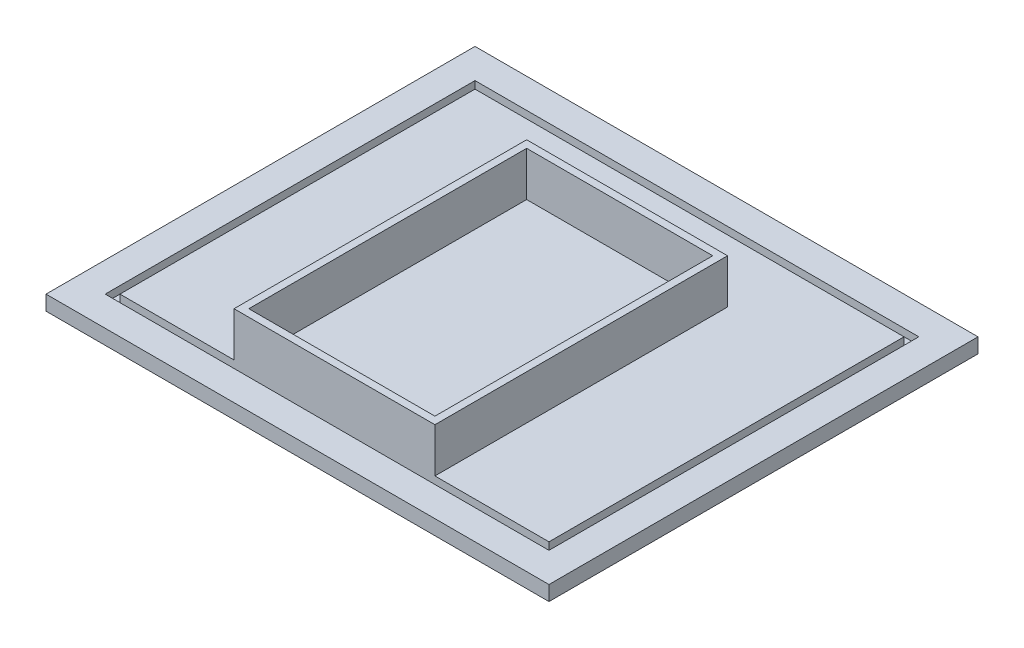
ISO-10303-21;
HEADER;
FILE_DESCRIPTION(('STEP AP214'),'2;1');
FILE_NAME('part.step','',(''),(''),'','','');
FILE_SCHEMA(('AUTOMOTIVE_DESIGN { 1 0 10303 214 1 1 1 1 }'));
ENDSEC;
DATA;
#1=APPLICATION_CONTEXT('core data for automotive mechanical design processes');
#2=APPLICATION_PROTOCOL_DEFINITION('international standard','automotive_design',2000,#1);
#3=PRODUCT_CONTEXT('',#1,'mechanical');
#4=PRODUCT('Part','Part','',(#3));
#5=PRODUCT_RELATED_PRODUCT_CATEGORY('part','',(#4));
#6=PRODUCT_DEFINITION_FORMATION('','',#4);
#7=PRODUCT_DEFINITION_CONTEXT('part definition',#1,'design');
#8=PRODUCT_DEFINITION('design','',#6,#7);
#9=PRODUCT_DEFINITION_SHAPE('','',#8);
#10=(LENGTH_UNIT() NAMED_UNIT(*) SI_UNIT(.MILLI.,.METRE.));
#11=(NAMED_UNIT(*) PLANE_ANGLE_UNIT() SI_UNIT($,.RADIAN.));
#12=(NAMED_UNIT(*) SI_UNIT($,.STERADIAN.) SOLID_ANGLE_UNIT());
#13=UNCERTAINTY_MEASURE_WITH_UNIT(LENGTH_MEASURE(1.E-05),#10,'distance_accuracy_value','');
#14=(GEOMETRIC_REPRESENTATION_CONTEXT(3) GLOBAL_UNCERTAINTY_ASSIGNED_CONTEXT((#13)) GLOBAL_UNIT_ASSIGNED_CONTEXT((#10,
#11,#12)) REPRESENTATION_CONTEXT('',''));
#15=CARTESIAN_POINT('',(0.,0.,0.));
#16=DIRECTION('',(0.,0.,1.));
#17=DIRECTION('',(1.,0.,0.));
#18=AXIS2_PLACEMENT_3D('',#15,#16,#17);
#19=CARTESIAN_POINT('',(0.,5.,0.));
#20=DIRECTION('',(0.,-1.,0.));
#21=DIRECTION('',(0.,0.,-1.));
#22=AXIS2_PLACEMENT_3D('',#19,#20,#21);
#23=PLANE('',#22);
#24=DIRECTION('',(0.,0.,1.));
#25=VECTOR('',#24,1.);
#26=CARTESIAN_POINT('',(-33.95,5.,60.));
#27=LINE('',#26,#25);
#28=CARTESIAN_POINT('',(-33.95,5.,-38.9));
#29=VERTEX_POINT('',#28);
#30=CARTESIAN_POINT('',(-33.95,5.,60.));
#31=VERTEX_POINT('',#30);
#32=EDGE_CURVE('E55',#29,#31,#27,.T.);
#33=ORIENTED_EDGE('',*,*,#32,.F.);
#34=DIRECTION('',(-1.,0.,0.));
#35=VECTOR('',#34,1.);
#36=CARTESIAN_POINT('',(33.95,5.,-38.9));
#37=LINE('',#36,#35);
#38=CARTESIAN_POINT('',(33.95,5.,-38.9));
#39=VERTEX_POINT('',#38);
#40=EDGE_CURVE('E234',#39,#29,#37,.T.);
#41=ORIENTED_EDGE('',*,*,#40,.F.);
#42=DIRECTION('',(0.,0.,-1.));
#43=VECTOR('',#42,1.);
#44=CARTESIAN_POINT('',(33.95,5.,60.));
#45=LINE('',#44,#43);
#46=CARTESIAN_POINT('',(33.95,5.,60.));
#47=VERTEX_POINT('',#46);
#48=EDGE_CURVE('E246',#47,#39,#45,.T.);
#49=ORIENTED_EDGE('',*,*,#48,.F.);
#50=DIRECTION('',(1.,0.,0.));
#51=VECTOR('',#50,1.);
#52=CARTESIAN_POINT('',(-72.5,5.,60.));
#53=LINE('',#52,#51);
#54=CARTESIAN_POINT('',(72.5,5.,60.));
#55=VERTEX_POINT('',#54);
#56=EDGE_CURVE('E267',#47,#55,#53,.T.);
#57=ORIENTED_EDGE('',*,*,#56,.T.);
#58=DIRECTION('',(0.,0.,-1.));
#59=VECTOR('',#58,1.);
#60=CARTESIAN_POINT('',(72.5,5.,-60.));
#61=LINE('',#60,#59);
#62=CARTESIAN_POINT('',(72.5,5.,-60.));
#63=VERTEX_POINT('',#62);
#64=EDGE_CURVE('E289',#55,#63,#61,.T.);
#65=ORIENTED_EDGE('',*,*,#64,.T.);
#66=DIRECTION('',(-1.,0.,0.));
#67=VECTOR('',#66,1.);
#68=CARTESIAN_POINT('',(-72.5,5.,-60.));
#69=LINE('',#68,#67);
#70=CARTESIAN_POINT('',(-72.5,5.,-60.));
#71=VERTEX_POINT('',#70);
#72=EDGE_CURVE('E293',#63,#71,#69,.T.);
#73=ORIENTED_EDGE('',*,*,#72,.T.);
#74=DIRECTION('',(0.,0.,1.));
#75=VECTOR('',#74,1.);
#76=CARTESIAN_POINT('',(-72.5,5.,-60.));
#77=LINE('',#76,#75);
#78=CARTESIAN_POINT('',(-72.5,5.,60.));
#79=VERTEX_POINT('',#78);
#80=EDGE_CURVE('E273',#71,#79,#77,.T.);
#81=ORIENTED_EDGE('',*,*,#80,.T.);
#82=EDGE_CURVE('E286',#79,#31,#53,.T.);
#83=ORIENTED_EDGE('',*,*,#82,.T.);
#84=EDGE_LOOP('',(#33,#41,#49,#57,#65,#73,#81,#83));
#85=FACE_BOUND('',#84,.T.);
#86=ADVANCED_FACE('F39',(#85),#23,.F.);
#87=CARTESIAN_POINT('',(85.,5.,72.5));
#88=DIRECTION('',(-1.,0.,0.));
#89=DIRECTION('',(0.,0.,1.));
#90=AXIS2_PLACEMENT_3D('',#87,#88,#89);
#91=PLANE('',#90);
#92=DIRECTION('',(0.,0.,-1.));
#93=VECTOR('',#92,1.);
#94=CARTESIAN_POINT('',(85.,0.,72.5));
#95=LINE('',#94,#93);
#96=CARTESIAN_POINT('',(85.,0.,72.5));
#97=VERTEX_POINT('',#96);
#98=CARTESIAN_POINT('',(85.,0.,-72.5));
#99=VERTEX_POINT('',#98);
#100=EDGE_CURVE('E348',#97,#99,#95,.T.);
#101=ORIENTED_EDGE('',*,*,#100,.T.);
#102=DIRECTION('',(0.,-1.,0.));
#103=VECTOR('',#102,1.);
#104=CARTESIAN_POINT('',(85.,5.,-72.5));
#105=LINE('',#104,#103);
#106=CARTESIAN_POINT('',(85.,5.,-72.5));
#107=VERTEX_POINT('',#106);
#108=EDGE_CURVE('E11',#107,#99,#105,.T.);
#109=ORIENTED_EDGE('',*,*,#108,.F.);
#110=DIRECTION('',(0.,0.,-1.));
#111=VECTOR('',#110,1.);
#112=CARTESIAN_POINT('',(85.,5.,72.5));
#113=LINE('',#112,#111);
#114=CARTESIAN_POINT('',(85.,5.,72.5));
#115=VERTEX_POINT('',#114);
#116=EDGE_CURVE('E358',#115,#107,#113,.T.);
#117=ORIENTED_EDGE('',*,*,#116,.F.);
#118=DIRECTION('',(0.,-1.,0.));
#119=VECTOR('',#118,1.);
#120=CARTESIAN_POINT('',(85.,5.,72.5));
#121=LINE('',#120,#119);
#122=EDGE_CURVE('E372',#115,#97,#121,.T.);
#123=ORIENTED_EDGE('',*,*,#122,.T.);
#124=EDGE_LOOP('',(#101,#109,#117,#123));
#125=FACE_BOUND('',#124,.T.);
#126=ADVANCED_FACE('F41',(#125),#91,.F.);
#127=CARTESIAN_POINT('',(-85.,5.,-72.5));
#128=DIRECTION('',(0.,0.,1.));
#129=DIRECTION('',(1.,0.,0.));
#130=AXIS2_PLACEMENT_3D('',#127,#128,#129);
#131=PLANE('',#130);
#132=DIRECTION('',(-1.,0.,0.));
#133=VECTOR('',#132,1.);
#134=CARTESIAN_POINT('',(-85.,0.,-72.5));
#135=LINE('',#134,#133);
#136=CARTESIAN_POINT('',(-85.,0.,-72.5));
#137=VERTEX_POINT('',#136);
#138=EDGE_CURVE('E376',#99,#137,#135,.T.);
#139=ORIENTED_EDGE('',*,*,#138,.T.);
#140=DIRECTION('',(0.,-1.,0.));
#141=VECTOR('',#140,1.);
#142=CARTESIAN_POINT('',(-85.,5.,-72.5));
#143=LINE('',#142,#141);
#144=CARTESIAN_POINT('',(-85.,5.,-72.5));
#145=VERTEX_POINT('',#144);
#146=EDGE_CURVE('E48',#145,#137,#143,.T.);
#147=ORIENTED_EDGE('',*,*,#146,.F.);
#148=DIRECTION('',(-1.,0.,0.));
#149=VECTOR('',#148,1.);
#150=CARTESIAN_POINT('',(-85.,5.,-72.5));
#151=LINE('',#150,#149);
#152=EDGE_CURVE('E362',#107,#145,#151,.T.);
#153=ORIENTED_EDGE('',*,*,#152,.F.);
#154=ORIENTED_EDGE('',*,*,#108,.T.);
#155=EDGE_LOOP('',(#139,#147,#153,#154));
#156=FACE_BOUND('',#155,.T.);
#157=ADVANCED_FACE('F412',(#156),#131,.F.);
#158=CARTESIAN_POINT('',(-85.,5.,72.5));
#159=DIRECTION('',(1.,0.,0.));
#160=DIRECTION('',(0.,0.,-1.));
#161=AXIS2_PLACEMENT_3D('',#158,#159,#160);
#162=PLANE('',#161);
#163=DIRECTION('',(0.,0.,1.));
#164=VECTOR('',#163,1.);
#165=CARTESIAN_POINT('',(-85.,0.,72.5));
#166=LINE('',#165,#164);
#167=CARTESIAN_POINT('',(-85.,0.,72.5));
#168=VERTEX_POINT('',#167);
#169=EDGE_CURVE('E379',#137,#168,#166,.T.);
#170=ORIENTED_EDGE('',*,*,#169,.T.);
#171=DIRECTION('',(0.,-1.,0.));
#172=VECTOR('',#171,1.);
#173=CARTESIAN_POINT('',(-85.,5.,72.5));
#174=LINE('',#173,#172);
#175=CARTESIAN_POINT('',(-85.,5.,72.5));
#176=VERTEX_POINT('',#175);
#177=EDGE_CURVE('E387',#176,#168,#174,.T.);
#178=ORIENTED_EDGE('',*,*,#177,.F.);
#179=DIRECTION('',(0.,0.,1.));
#180=VECTOR('',#179,1.);
#181=CARTESIAN_POINT('',(-85.,5.,72.5));
#182=LINE('',#181,#180);
#183=EDGE_CURVE('E366',#145,#176,#182,.T.);
#184=ORIENTED_EDGE('',*,*,#183,.F.);
#185=ORIENTED_EDGE('',*,*,#146,.T.);
#186=EDGE_LOOP('',(#170,#178,#184,#185));
#187=FACE_BOUND('',#186,.T.);
#188=ADVANCED_FACE('F396',(#187),#162,.F.);
#189=CARTESIAN_POINT('',(-85.,5.,72.5));
#190=DIRECTION('',(0.,0.,-1.));
#191=DIRECTION('',(-1.,0.,0.));
#192=AXIS2_PLACEMENT_3D('',#189,#190,#191);
#193=PLANE('',#192);
#194=DIRECTION('',(1.,0.,0.));
#195=VECTOR('',#194,1.);
#196=CARTESIAN_POINT('',(-85.,0.,72.5));
#197=LINE('',#196,#195);
#198=EDGE_CURVE('E363',#168,#97,#197,.T.);
#199=ORIENTED_EDGE('',*,*,#198,.T.);
#200=ORIENTED_EDGE('',*,*,#122,.F.);
#201=DIRECTION('',(1.,0.,0.));
#202=VECTOR('',#201,1.);
#203=CARTESIAN_POINT('',(-85.,5.,72.5));
#204=LINE('',#203,#202);
#205=EDGE_CURVE('E369',#176,#115,#204,.T.);
#206=ORIENTED_EDGE('',*,*,#205,.F.);
#207=ORIENTED_EDGE('',*,*,#177,.T.);
#208=EDGE_LOOP('',(#199,#200,#206,#207));
#209=FACE_BOUND('',#208,.T.);
#210=ADVANCED_FACE('F405',(#209),#193,.F.);
#211=DIRECTION('',(-1.,0.,0.));
#212=VECTOR('',#211,1.);
#213=CARTESIAN_POINT('',(-75.,5.,-62.5));
#214=LINE('',#213,#212);
#215=CARTESIAN_POINT('',(75.,5.,-62.5));
#216=VERTEX_POINT('',#215);
#217=CARTESIAN_POINT('',(-75.,5.,-62.5));
#218=VERTEX_POINT('',#217);
#219=EDGE_CURVE('E334',#216,#218,#214,.T.);
#220=ORIENTED_EDGE('',*,*,#219,.F.);
#221=DIRECTION('',(0.,0.,-1.));
#222=VECTOR('',#221,1.);
#223=CARTESIAN_POINT('',(75.,5.,62.5));
#224=LINE('',#223,#222);
#225=CARTESIAN_POINT('',(75.,5.,62.5));
#226=VERTEX_POINT('',#225);
#227=EDGE_CURVE('E303',#226,#216,#224,.T.);
#228=ORIENTED_EDGE('',*,*,#227,.F.);
#229=DIRECTION('',(1.,0.,0.));
#230=VECTOR('',#229,1.);
#231=CARTESIAN_POINT('',(-75.,5.,62.5));
#232=LINE('',#231,#230);
#233=CARTESIAN_POINT('',(-75.,5.,62.5));
#234=VERTEX_POINT('',#233);
#235=EDGE_CURVE('E319',#234,#226,#232,.T.);
#236=ORIENTED_EDGE('',*,*,#235,.F.);
#237=DIRECTION('',(0.,0.,1.));
#238=VECTOR('',#237,1.);
#239=CARTESIAN_POINT('',(-75.,5.,62.5));
#240=LINE('',#239,#238);
#241=EDGE_CURVE('E338',#218,#234,#240,.T.);
#242=ORIENTED_EDGE('',*,*,#241,.F.);
#243=EDGE_LOOP('',(#220,#228,#236,#242));
#244=FACE_BOUND('',#243,.T.);
#245=ORIENTED_EDGE('',*,*,#116,.T.);
#246=ORIENTED_EDGE('',*,*,#152,.T.);
#247=ORIENTED_EDGE('',*,*,#183,.T.);
#248=ORIENTED_EDGE('',*,*,#205,.T.);
#249=EDGE_LOOP('',(#245,#246,#247,#248));
#250=FACE_BOUND('',#249,.T.);
#251=ADVANCED_FACE('F411',(#244,#250),#23,.F.);
#252=CARTESIAN_POINT('',(0.,0.,0.));
#253=DIRECTION('',(0.,-1.,0.));
#254=DIRECTION('',(0.,0.,-1.));
#255=AXIS2_PLACEMENT_3D('',#252,#253,#254);
#256=PLANE('',#255);
#257=ORIENTED_EDGE('',*,*,#100,.F.);
#258=ORIENTED_EDGE('',*,*,#198,.F.);
#259=ORIENTED_EDGE('',*,*,#169,.F.);
#260=ORIENTED_EDGE('',*,*,#138,.F.);
#261=EDGE_LOOP('',(#257,#258,#259,#260));
#262=FACE_BOUND('',#261,.T.);
#263=ADVANCED_FACE('F402',(#262),#256,.T.);
#264=CARTESIAN_POINT('',(75.,2.5,62.5));
#265=DIRECTION('',(1.,0.,0.));
#266=DIRECTION('',(0.,0.,-1.));
#267=AXIS2_PLACEMENT_3D('',#264,#265,#266);
#268=PLANE('',#267);
#269=ORIENTED_EDGE('',*,*,#227,.T.);
#270=DIRECTION('',(0.,1.,0.));
#271=VECTOR('',#270,1.);
#272=CARTESIAN_POINT('',(75.,2.5,-62.5));
#273=LINE('',#272,#271);
#274=CARTESIAN_POINT('',(75.,2.5,-62.5));
#275=VERTEX_POINT('',#274);
#276=EDGE_CURVE('E331',#275,#216,#273,.T.);
#277=ORIENTED_EDGE('',*,*,#276,.F.);
#278=DIRECTION('',(0.,0.,-1.));
#279=VECTOR('',#278,1.);
#280=CARTESIAN_POINT('',(75.,2.5,62.5));
#281=LINE('',#280,#279);
#282=CARTESIAN_POINT('',(75.,2.5,62.5));
#283=VERTEX_POINT('',#282);
#284=EDGE_CURVE('E314',#283,#275,#281,.T.);
#285=ORIENTED_EDGE('',*,*,#284,.F.);
#286=DIRECTION('',(0.,1.,0.));
#287=VECTOR('',#286,1.);
#288=CARTESIAN_POINT('',(75.,2.5,62.5));
#289=LINE('',#288,#287);
#290=EDGE_CURVE('E345',#283,#226,#289,.T.);
#291=ORIENTED_EDGE('',*,*,#290,.T.);
#292=EDGE_LOOP('',(#269,#277,#285,#291));
#293=FACE_BOUND('',#292,.T.);
#294=ADVANCED_FACE('F437',(#293),#268,.F.);
#295=CARTESIAN_POINT('',(-75.,2.5,62.5));
#296=DIRECTION('',(0.,0.,1.));
#297=DIRECTION('',(1.,0.,0.));
#298=AXIS2_PLACEMENT_3D('',#295,#296,#297);
#299=PLANE('',#298);
#300=ORIENTED_EDGE('',*,*,#235,.T.);
#301=ORIENTED_EDGE('',*,*,#290,.F.);
#302=DIRECTION('',(1.,0.,0.));
#303=VECTOR('',#302,1.);
#304=CARTESIAN_POINT('',(-75.,2.5,62.5));
#305=LINE('',#304,#303);
#306=CARTESIAN_POINT('',(-75.,2.5,62.5));
#307=VERTEX_POINT('',#306);
#308=EDGE_CURVE('E327',#307,#283,#305,.T.);
#309=ORIENTED_EDGE('',*,*,#308,.F.);
#310=DIRECTION('',(0.,1.,0.));
#311=VECTOR('',#310,1.);
#312=CARTESIAN_POINT('',(-75.,2.5,62.5));
#313=LINE('',#312,#311);
#314=EDGE_CURVE('E349',#307,#234,#313,.T.);
#315=ORIENTED_EDGE('',*,*,#314,.T.);
#316=EDGE_LOOP('',(#300,#301,#309,#315));
#317=FACE_BOUND('',#316,.T.);
#318=ADVANCED_FACE('F451',(#317),#299,.F.);
#319=CARTESIAN_POINT('',(-75.,2.5,62.5));
#320=DIRECTION('',(-1.,0.,0.));
#321=DIRECTION('',(0.,0.,1.));
#322=AXIS2_PLACEMENT_3D('',#319,#320,#321);
#323=PLANE('',#322);
#324=ORIENTED_EDGE('',*,*,#241,.T.);
#325=ORIENTED_EDGE('',*,*,#314,.F.);
#326=DIRECTION('',(0.,0.,1.));
#327=VECTOR('',#326,1.);
#328=CARTESIAN_POINT('',(-75.,2.5,62.5));
#329=LINE('',#328,#327);
#330=CARTESIAN_POINT('',(-75.,2.5,-62.5));
#331=VERTEX_POINT('',#330);
#332=EDGE_CURVE('E323',#331,#307,#329,.T.);
#333=ORIENTED_EDGE('',*,*,#332,.F.);
#334=DIRECTION('',(0.,1.,0.));
#335=VECTOR('',#334,1.);
#336=CARTESIAN_POINT('',(-75.,2.5,-62.5));
#337=LINE('',#336,#335);
#338=EDGE_CURVE('E352',#331,#218,#337,.T.);
#339=ORIENTED_EDGE('',*,*,#338,.T.);
#340=EDGE_LOOP('',(#324,#325,#333,#339));
#341=FACE_BOUND('',#340,.T.);
#342=ADVANCED_FACE('F453',(#341),#323,.F.);
#343=CARTESIAN_POINT('',(-75.,2.5,-62.5));
#344=DIRECTION('',(0.,0.,-1.));
#345=DIRECTION('',(-1.,0.,0.));
#346=AXIS2_PLACEMENT_3D('',#343,#344,#345);
#347=PLANE('',#346);
#348=ORIENTED_EDGE('',*,*,#219,.T.);
#349=ORIENTED_EDGE('',*,*,#338,.F.);
#350=DIRECTION('',(-1.,0.,0.));
#351=VECTOR('',#350,1.);
#352=CARTESIAN_POINT('',(-75.,2.5,-62.5));
#353=LINE('',#352,#351);
#354=EDGE_CURVE('E318',#275,#331,#353,.T.);
#355=ORIENTED_EDGE('',*,*,#354,.F.);
#356=ORIENTED_EDGE('',*,*,#276,.T.);
#357=EDGE_LOOP('',(#348,#349,#355,#356));
#358=FACE_BOUND('',#357,.T.);
#359=ADVANCED_FACE('F444',(#358),#347,.F.);
#360=CARTESIAN_POINT('',(0.,2.5,0.));
#361=DIRECTION('',(0.,-1.,0.));
#362=DIRECTION('',(0.,0.,-1.));
#363=AXIS2_PLACEMENT_3D('',#360,#361,#362);
#364=PLANE('',#363);
#365=DIRECTION('',(1.,0.,0.));
#366=VECTOR('',#365,1.);
#367=CARTESIAN_POINT('',(-72.5,2.5,60.));
#368=LINE('',#367,#366);
#369=CARTESIAN_POINT('',(-72.5,2.5,60.));
#370=VERTEX_POINT('',#369);
#371=CARTESIAN_POINT('',(72.5,2.5,60.));
#372=VERTEX_POINT('',#371);
#373=EDGE_CURVE('E268',#370,#372,#368,.T.);
#374=ORIENTED_EDGE('',*,*,#373,.F.);
#375=DIRECTION('',(0.,0.,1.));
#376=VECTOR('',#375,1.);
#377=CARTESIAN_POINT('',(-72.5,2.5,-60.));
#378=LINE('',#377,#376);
#379=CARTESIAN_POINT('',(-72.5,2.5,-60.));
#380=VERTEX_POINT('',#379);
#381=EDGE_CURVE('E281',#380,#370,#378,.T.);
#382=ORIENTED_EDGE('',*,*,#381,.F.);
#383=DIRECTION('',(-1.,0.,0.));
#384=VECTOR('',#383,1.);
#385=CARTESIAN_POINT('',(-72.5,2.5,-60.));
#386=LINE('',#385,#384);
#387=CARTESIAN_POINT('',(72.5,2.5,-60.));
#388=VERTEX_POINT('',#387);
#389=EDGE_CURVE('E277',#388,#380,#386,.T.);
#390=ORIENTED_EDGE('',*,*,#389,.F.);
#391=DIRECTION('',(0.,0.,-1.));
#392=VECTOR('',#391,1.);
#393=CARTESIAN_POINT('',(72.5,2.5,-60.));
#394=LINE('',#393,#392);
#395=EDGE_CURVE('E272',#372,#388,#394,.T.);
#396=ORIENTED_EDGE('',*,*,#395,.F.);
#397=EDGE_LOOP('',(#374,#382,#390,#396));
#398=FACE_BOUND('',#397,.T.);
#399=ORIENTED_EDGE('',*,*,#284,.T.);
#400=ORIENTED_EDGE('',*,*,#354,.T.);
#401=ORIENTED_EDGE('',*,*,#332,.T.);
#402=ORIENTED_EDGE('',*,*,#308,.T.);
#403=EDGE_LOOP('',(#399,#400,#401,#402));
#404=FACE_BOUND('',#403,.T.);
#405=ADVANCED_FACE('F455',(#398,#404),#364,.F.);
#406=CARTESIAN_POINT('',(-72.5,2.5,60.));
#407=DIRECTION('',(0.,0.,1.));
#408=DIRECTION('',(1.,0.,0.));
#409=AXIS2_PLACEMENT_3D('',#406,#407,#408);
#410=PLANE('',#409);
#411=ORIENTED_EDGE('',*,*,#82,.F.);
#412=DIRECTION('',(0.,1.,0.));
#413=VECTOR('',#412,1.);
#414=CARTESIAN_POINT('',(-72.5,2.5,60.));
#415=LINE('',#414,#413);
#416=EDGE_CURVE('E300',#370,#79,#415,.T.);
#417=ORIENTED_EDGE('',*,*,#416,.F.);
#418=ORIENTED_EDGE('',*,*,#373,.T.);
#419=DIRECTION('',(0.,1.,0.));
#420=VECTOR('',#419,1.);
#421=CARTESIAN_POINT('',(72.5,2.5,60.));
#422=LINE('',#421,#420);
#423=EDGE_CURVE('E285',#372,#55,#422,.T.);
#424=ORIENTED_EDGE('',*,*,#423,.T.);
#425=ORIENTED_EDGE('',*,*,#56,.F.);
#426=DIRECTION('',(0.,-1.,0.));
#427=VECTOR('',#426,1.);
#428=CARTESIAN_POINT('',(33.95,20.,60.));
#429=LINE('',#428,#427);
#430=CARTESIAN_POINT('',(33.95,20.,60.));
#431=VERTEX_POINT('',#430);
#432=EDGE_CURVE('E259',#431,#47,#429,.T.);
#433=ORIENTED_EDGE('',*,*,#432,.F.);
#434=DIRECTION('',(1.,0.,0.));
#435=VECTOR('',#434,1.);
#436=CARTESIAN_POINT('',(33.95,20.,60.));
#437=LINE('',#436,#435);
#438=CARTESIAN_POINT('',(-33.95,20.,60.));
#439=VERTEX_POINT('',#438);
#440=EDGE_CURVE('E233',#439,#431,#437,.T.);
#441=ORIENTED_EDGE('',*,*,#440,.F.);
#442=DIRECTION('',(0.,-1.,0.));
#443=VECTOR('',#442,1.);
#444=CARTESIAN_POINT('',(-33.95,20.,60.));
#445=LINE('',#444,#443);
#446=EDGE_CURVE('E263',#439,#31,#445,.T.);
#447=ORIENTED_EDGE('',*,*,#446,.T.);
#448=EDGE_LOOP('',(#411,#417,#418,#424,#425,#433,#441,#447));
#449=FACE_BOUND('',#448,.T.);
#450=ADVANCED_FACE('F457',(#449),#410,.T.);
#451=CARTESIAN_POINT('',(-72.5,2.5,-60.));
#452=DIRECTION('',(-1.,0.,0.));
#453=DIRECTION('',(0.,0.,1.));
#454=AXIS2_PLACEMENT_3D('',#451,#452,#453);
#455=PLANE('',#454);
#456=ORIENTED_EDGE('',*,*,#80,.F.);
#457=DIRECTION('',(0.,1.,0.));
#458=VECTOR('',#457,1.);
#459=CARTESIAN_POINT('',(-72.5,2.5,-60.));
#460=LINE('',#459,#458);
#461=EDGE_CURVE('E304',#380,#71,#460,.T.);
#462=ORIENTED_EDGE('',*,*,#461,.F.);
#463=ORIENTED_EDGE('',*,*,#381,.T.);
#464=ORIENTED_EDGE('',*,*,#416,.T.);
#465=EDGE_LOOP('',(#456,#462,#463,#464));
#466=FACE_BOUND('',#465,.T.);
#467=ADVANCED_FACE('F465',(#466),#455,.T.);
#468=CARTESIAN_POINT('',(-72.5,2.5,-60.));
#469=DIRECTION('',(0.,0.,-1.));
#470=DIRECTION('',(-1.,0.,0.));
#471=AXIS2_PLACEMENT_3D('',#468,#469,#470);
#472=PLANE('',#471);
#473=ORIENTED_EDGE('',*,*,#72,.F.);
#474=DIRECTION('',(0.,1.,0.));
#475=VECTOR('',#474,1.);
#476=CARTESIAN_POINT('',(72.5,2.5,-60.));
#477=LINE('',#476,#475);
#478=EDGE_CURVE('E307',#388,#63,#477,.T.);
#479=ORIENTED_EDGE('',*,*,#478,.F.);
#480=ORIENTED_EDGE('',*,*,#389,.T.);
#481=ORIENTED_EDGE('',*,*,#461,.T.);
#482=EDGE_LOOP('',(#473,#479,#480,#481));
#483=FACE_BOUND('',#482,.T.);
#484=ADVANCED_FACE('F505',(#483),#472,.T.);
#485=CARTESIAN_POINT('',(72.5,2.5,-60.));
#486=DIRECTION('',(1.,0.,0.));
#487=DIRECTION('',(0.,0.,-1.));
#488=AXIS2_PLACEMENT_3D('',#485,#486,#487);
#489=PLANE('',#488);
#490=ORIENTED_EDGE('',*,*,#64,.F.);
#491=ORIENTED_EDGE('',*,*,#423,.F.);
#492=ORIENTED_EDGE('',*,*,#395,.T.);
#493=ORIENTED_EDGE('',*,*,#478,.T.);
#494=EDGE_LOOP('',(#490,#491,#492,#493));
#495=FACE_BOUND('',#494,.T.);
#496=ADVANCED_FACE('F514',(#495),#489,.T.);
#497=CARTESIAN_POINT('',(0.,20.,0.));
#498=DIRECTION('',(0.,1.,0.));
#499=DIRECTION('',(0.,0.,1.));
#500=AXIS2_PLACEMENT_3D('',#497,#498,#499);
#501=PLANE('',#500);
#502=DIRECTION('',(0.,0.,1.));
#503=VECTOR('',#502,1.);
#504=CARTESIAN_POINT('',(-33.95,20.,60.));
#505=LINE('',#504,#503);
#506=CARTESIAN_POINT('',(-33.95,20.,-38.9));
#507=VERTEX_POINT('',#506);
#508=EDGE_CURVE('E229',#507,#439,#505,.T.);
#509=ORIENTED_EDGE('',*,*,#508,.T.);
#510=ORIENTED_EDGE('',*,*,#440,.T.);
#511=DIRECTION('',(0.,0.,-1.));
#512=VECTOR('',#511,1.);
#513=CARTESIAN_POINT('',(33.95,20.,60.));
#514=LINE('',#513,#512);
#515=CARTESIAN_POINT('',(33.95,20.,-38.9));
#516=VERTEX_POINT('',#515);
#517=EDGE_CURVE('E237',#431,#516,#514,.T.);
#518=ORIENTED_EDGE('',*,*,#517,.T.);
#519=DIRECTION('',(-1.,0.,0.));
#520=VECTOR('',#519,1.);
#521=CARTESIAN_POINT('',(33.95,20.,-38.9));
#522=LINE('',#521,#520);
#523=EDGE_CURVE('E240',#516,#507,#522,.T.);
#524=ORIENTED_EDGE('',*,*,#523,.T.);
#525=EDGE_LOOP('',(#509,#510,#518,#524));
#526=FACE_BOUND('',#525,.T.);
#527=DIRECTION('',(1.,0.,0.));
#528=VECTOR('',#527,1.);
#529=CARTESIAN_POINT('',(31.45,20.,57.5));
#530=LINE('',#529,#528);
#531=CARTESIAN_POINT('',(-31.45,20.,57.5));
#532=VERTEX_POINT('',#531);
#533=CARTESIAN_POINT('',(31.45,20.,57.5));
#534=VERTEX_POINT('',#533);
#535=EDGE_CURVE('E187',#532,#534,#530,.T.);
#536=ORIENTED_EDGE('',*,*,#535,.F.);
#537=DIRECTION('',(0.,0.,1.));
#538=VECTOR('',#537,1.);
#539=CARTESIAN_POINT('',(-31.45,20.,57.5));
#540=LINE('',#539,#538);
#541=CARTESIAN_POINT('',(-31.45,20.,-36.4));
#542=VERTEX_POINT('',#541);
#543=EDGE_CURVE('E178',#542,#532,#540,.T.);
#544=ORIENTED_EDGE('',*,*,#543,.F.);
#545=DIRECTION('',(-1.,0.,0.));
#546=VECTOR('',#545,1.);
#547=CARTESIAN_POINT('',(31.45,20.,-36.4));
#548=LINE('',#547,#546);
#549=CARTESIAN_POINT('',(31.45,20.,-36.4));
#550=VERTEX_POINT('',#549);
#551=EDGE_CURVE('E205',#550,#542,#548,.T.);
#552=ORIENTED_EDGE('',*,*,#551,.F.);
#553=DIRECTION('',(0.,0.,-1.));
#554=VECTOR('',#553,1.);
#555=CARTESIAN_POINT('',(31.45,20.,57.5));
#556=LINE('',#555,#554);
#557=EDGE_CURVE('E201',#534,#550,#556,.T.);
#558=ORIENTED_EDGE('',*,*,#557,.F.);
#559=EDGE_LOOP('',(#536,#544,#552,#558));
#560=FACE_BOUND('',#559,.T.);
#561=ADVANCED_FACE('F199',(#526,#560),#501,.T.);
#562=CARTESIAN_POINT('',(-33.95,20.,60.));
#563=DIRECTION('',(1.,0.,0.));
#564=DIRECTION('',(0.,0.,-1.));
#565=AXIS2_PLACEMENT_3D('',#562,#563,#564);
#566=PLANE('',#565);
#567=ORIENTED_EDGE('',*,*,#32,.T.);
#568=ORIENTED_EDGE('',*,*,#446,.F.);
#569=ORIENTED_EDGE('',*,*,#508,.F.);
#570=DIRECTION('',(0.,-1.,0.));
#571=VECTOR('',#570,1.);
#572=CARTESIAN_POINT('',(-33.95,20.,-38.9));
#573=LINE('',#572,#571);
#574=EDGE_CURVE('E243',#507,#29,#573,.T.);
#575=ORIENTED_EDGE('',*,*,#574,.T.);
#576=EDGE_LOOP('',(#567,#568,#569,#575));
#577=FACE_BOUND('',#576,.T.);
#578=ADVANCED_FACE('F546',(#577),#566,.F.);
#579=CARTESIAN_POINT('',(33.95,20.,60.));
#580=DIRECTION('',(-1.,0.,0.));
#581=DIRECTION('',(0.,0.,1.));
#582=AXIS2_PLACEMENT_3D('',#579,#580,#581);
#583=PLANE('',#582);
#584=ORIENTED_EDGE('',*,*,#48,.T.);
#585=DIRECTION('',(0.,-1.,0.));
#586=VECTOR('',#585,1.);
#587=CARTESIAN_POINT('',(33.95,20.,-38.9));
#588=LINE('',#587,#586);
#589=EDGE_CURVE('E255',#516,#39,#588,.T.);
#590=ORIENTED_EDGE('',*,*,#589,.F.);
#591=ORIENTED_EDGE('',*,*,#517,.F.);
#592=ORIENTED_EDGE('',*,*,#432,.T.);
#593=EDGE_LOOP('',(#584,#590,#591,#592));
#594=FACE_BOUND('',#593,.T.);
#595=ADVANCED_FACE('F554',(#594),#583,.F.);
#596=CARTESIAN_POINT('',(33.95,20.,-38.9));
#597=DIRECTION('',(0.,0.,1.));
#598=DIRECTION('',(1.,0.,0.));
#599=AXIS2_PLACEMENT_3D('',#596,#597,#598);
#600=PLANE('',#599);
#601=ORIENTED_EDGE('',*,*,#40,.T.);
#602=ORIENTED_EDGE('',*,*,#574,.F.);
#603=ORIENTED_EDGE('',*,*,#523,.F.);
#604=ORIENTED_EDGE('',*,*,#589,.T.);
#605=EDGE_LOOP('',(#601,#602,#603,#604));
#606=FACE_BOUND('',#605,.T.);
#607=ADVANCED_FACE('F562',(#606),#600,.F.);
#608=CARTESIAN_POINT('',(-31.45,20.,57.5));
#609=DIRECTION('',(1.,0.,0.));
#610=DIRECTION('',(0.,0.,-1.));
#611=AXIS2_PLACEMENT_3D('',#608,#609,#610);
#612=PLANE('',#611);
#613=DIRECTION('',(0.,0.,1.));
#614=VECTOR('',#613,1.);
#615=CARTESIAN_POINT('',(-31.45,5.,57.5));
#616=LINE('',#615,#614);
#617=CARTESIAN_POINT('',(-31.45,5.,-36.4));
#618=VERTEX_POINT('',#617);
#619=CARTESIAN_POINT('',(-31.45,5.,57.5));
#620=VERTEX_POINT('',#619);
#621=EDGE_CURVE('E210',#618,#620,#616,.T.);
#622=ORIENTED_EDGE('',*,*,#621,.F.);
#623=DIRECTION('',(0.,-1.,0.));
#624=VECTOR('',#623,1.);
#625=CARTESIAN_POINT('',(-31.45,20.,-36.4));
#626=LINE('',#625,#624);
#627=EDGE_CURVE('E63',#542,#618,#626,.T.);
#628=ORIENTED_EDGE('',*,*,#627,.F.);
#629=ORIENTED_EDGE('',*,*,#543,.T.);
#630=DIRECTION('',(0.,-1.,0.));
#631=VECTOR('',#630,1.);
#632=CARTESIAN_POINT('',(-31.45,20.,57.5));
#633=LINE('',#632,#631);
#634=EDGE_CURVE('E181',#532,#620,#633,.T.);
#635=ORIENTED_EDGE('',*,*,#634,.T.);
#636=EDGE_LOOP('',(#622,#628,#629,#635));
#637=FACE_BOUND('',#636,.T.);
#638=ADVANCED_FACE('F180',(#637),#612,.T.);
#639=CARTESIAN_POINT('',(31.45,20.,57.5));
#640=DIRECTION('',(0.,0.,-1.));
#641=DIRECTION('',(-1.,0.,0.));
#642=AXIS2_PLACEMENT_3D('',#639,#640,#641);
#643=PLANE('',#642);
#644=DIRECTION('',(1.,0.,0.));
#645=VECTOR('',#644,1.);
#646=CARTESIAN_POINT('',(31.45,5.,57.5));
#647=LINE('',#646,#645);
#648=CARTESIAN_POINT('',(31.45,5.,57.5));
#649=VERTEX_POINT('',#648);
#650=EDGE_CURVE('E194',#620,#649,#647,.T.);
#651=ORIENTED_EDGE('',*,*,#650,.F.);
#652=ORIENTED_EDGE('',*,*,#634,.F.);
#653=ORIENTED_EDGE('',*,*,#535,.T.);
#654=DIRECTION('',(0.,-1.,0.));
#655=VECTOR('',#654,1.);
#656=CARTESIAN_POINT('',(31.45,20.,57.5));
#657=LINE('',#656,#655);
#658=EDGE_CURVE('E196',#534,#649,#657,.T.);
#659=ORIENTED_EDGE('',*,*,#658,.T.);
#660=EDGE_LOOP('',(#651,#652,#653,#659));
#661=FACE_BOUND('',#660,.T.);
#662=ADVANCED_FACE('F191',(#661),#643,.T.);
#663=CARTESIAN_POINT('',(31.45,20.,57.5));
#664=DIRECTION('',(-1.,0.,0.));
#665=DIRECTION('',(0.,0.,1.));
#666=AXIS2_PLACEMENT_3D('',#663,#664,#665);
#667=PLANE('',#666);
#668=DIRECTION('',(0.,0.,-1.));
#669=VECTOR('',#668,1.);
#670=CARTESIAN_POINT('',(31.45,5.,57.5));
#671=LINE('',#670,#669);
#672=CARTESIAN_POINT('',(31.45,5.,-36.4));
#673=VERTEX_POINT('',#672);
#674=EDGE_CURVE('E215',#649,#673,#671,.T.);
#675=ORIENTED_EDGE('',*,*,#674,.F.);
#676=ORIENTED_EDGE('',*,*,#658,.F.);
#677=ORIENTED_EDGE('',*,*,#557,.T.);
#678=DIRECTION('',(0.,-1.,0.));
#679=VECTOR('',#678,1.);
#680=CARTESIAN_POINT('',(31.45,20.,-36.4));
#681=LINE('',#680,#679);
#682=EDGE_CURVE('E224',#550,#673,#681,.T.);
#683=ORIENTED_EDGE('',*,*,#682,.T.);
#684=EDGE_LOOP('',(#675,#676,#677,#683));
#685=FACE_BOUND('',#684,.T.);
#686=ADVANCED_FACE('F583',(#685),#667,.T.);
#687=CARTESIAN_POINT('',(31.45,20.,-36.4));
#688=DIRECTION('',(0.,0.,1.));
#689=DIRECTION('',(1.,0.,0.));
#690=AXIS2_PLACEMENT_3D('',#687,#688,#689);
#691=PLANE('',#690);
#692=DIRECTION('',(-1.,0.,0.));
#693=VECTOR('',#692,1.);
#694=CARTESIAN_POINT('',(31.45,5.,-36.4));
#695=LINE('',#694,#693);
#696=EDGE_CURVE('E188',#673,#618,#695,.T.);
#697=ORIENTED_EDGE('',*,*,#696,.F.);
#698=ORIENTED_EDGE('',*,*,#682,.F.);
#699=ORIENTED_EDGE('',*,*,#551,.T.);
#700=ORIENTED_EDGE('',*,*,#627,.T.);
#701=EDGE_LOOP('',(#697,#698,#699,#700));
#702=FACE_BOUND('',#701,.T.);
#703=ADVANCED_FACE('F429',(#702),#691,.T.);
#704=ORIENTED_EDGE('',*,*,#696,.T.);
#705=ORIENTED_EDGE('',*,*,#621,.T.);
#706=ORIENTED_EDGE('',*,*,#650,.T.);
#707=ORIENTED_EDGE('',*,*,#674,.T.);
#708=EDGE_LOOP('',(#704,#705,#706,#707));
#709=FACE_BOUND('',#708,.T.);
#710=ADVANCED_FACE('F421',(#709),#23,.F.);
#711=CLOSED_SHELL('',(#86,#126,#157,#188,#210,#251,#263,#294,#318,#342,#359,#405,#450,#467,#484,
#496,#561,#578,#595,#607,#638,#662,#686,#703,#710));
#712=MANIFOLD_SOLID_BREP('B2',#711);
#713=ADVANCED_BREP_SHAPE_REPRESENTATION('',(#18,#712),#14);
#714=SHAPE_DEFINITION_REPRESENTATION(#9,#713);
ENDSEC;
END-ISO-10303-21;
